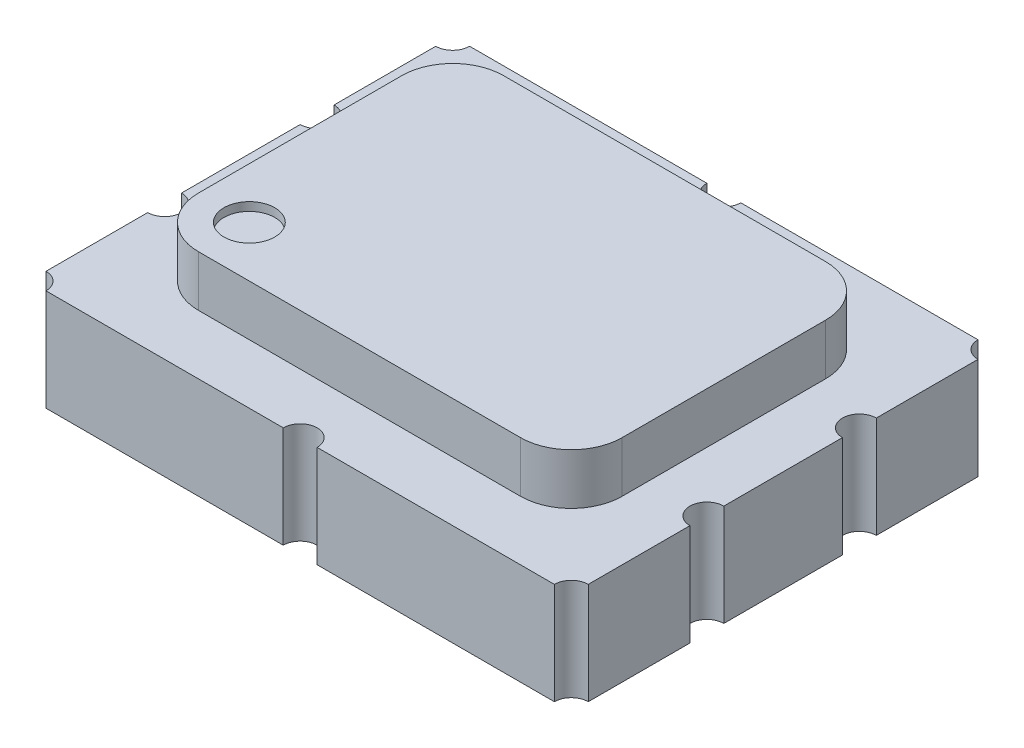
ISO-10303-21;
HEADER;
FILE_DESCRIPTION(('STEP AP214'),'2;1');
FILE_NAME('part.step','',(''),(''),'','','');
FILE_SCHEMA(('AUTOMOTIVE_DESIGN { 1 0 10303 214 1 1 1 1 }'));
ENDSEC;
DATA;
#1=APPLICATION_CONTEXT('core data for automotive mechanical design processes');
#2=APPLICATION_PROTOCOL_DEFINITION('international standard','automotive_design',2000,#1);
#3=PRODUCT_CONTEXT('',#1,'mechanical');
#4=PRODUCT('Part','Part','',(#3));
#5=PRODUCT_RELATED_PRODUCT_CATEGORY('part','',(#4));
#6=PRODUCT_DEFINITION_FORMATION('','',#4);
#7=PRODUCT_DEFINITION_CONTEXT('part definition',#1,'design');
#8=PRODUCT_DEFINITION('design','',#6,#7);
#9=PRODUCT_DEFINITION_SHAPE('','',#8);
#10=(LENGTH_UNIT() NAMED_UNIT(*) SI_UNIT(.MILLI.,.METRE.));
#11=(NAMED_UNIT(*) PLANE_ANGLE_UNIT() SI_UNIT($,.RADIAN.));
#12=(NAMED_UNIT(*) SI_UNIT($,.STERADIAN.) SOLID_ANGLE_UNIT());
#13=UNCERTAINTY_MEASURE_WITH_UNIT(LENGTH_MEASURE(1.E-05),#10,'distance_accuracy_value','');
#14=(GEOMETRIC_REPRESENTATION_CONTEXT(3) GLOBAL_UNCERTAINTY_ASSIGNED_CONTEXT((#13)) GLOBAL_UNIT_ASSIGNED_CONTEXT((#10,
#11,#12)) REPRESENTATION_CONTEXT('',''));
#15=CARTESIAN_POINT('',(0.,0.,0.));
#16=DIRECTION('',(0.,0.,1.));
#17=DIRECTION('',(1.,0.,0.));
#18=AXIS2_PLACEMENT_3D('',#15,#16,#17);
#19=CARTESIAN_POINT('',(1.6,0.6,-1.25));
#20=DIRECTION('',(-1.,0.,0.));
#21=DIRECTION('',(0.,0.,1.));
#22=AXIS2_PLACEMENT_3D('',#19,#20,#21);
#23=PLANE('',#22);
#24=DIRECTION('',(0.,0.,-1.));
#25=VECTOR('',#24,1.);
#26=CARTESIAN_POINT('',(1.6,0.6,-1.25));
#27=LINE('',#26,#25);
#28=CARTESIAN_POINT('',(1.6,0.6,1.15));
#29=VERTEX_POINT('',#28);
#30=CARTESIAN_POINT('',(1.6,0.6,0.55));
#31=VERTEX_POINT('',#30);
#32=EDGE_CURVE('E300',#29,#31,#27,.T.);
#33=ORIENTED_EDGE('',*,*,#32,.F.);
#34=DIRECTION('',(0.,1.,0.));
#35=VECTOR('',#34,1.);
#36=CARTESIAN_POINT('',(1.6,0.,1.15));
#37=LINE('',#36,#35);
#38=CARTESIAN_POINT('',(1.6,0.,1.15));
#39=VERTEX_POINT('',#38);
#40=EDGE_CURVE('E371',#29,#39,#37,.F.);
#41=ORIENTED_EDGE('',*,*,#40,.T.);
#42=DIRECTION('',(0.,0.,-1.));
#43=VECTOR('',#42,1.);
#44=CARTESIAN_POINT('',(1.6,0.,-1.25));
#45=LINE('',#44,#43);
#46=CARTESIAN_POINT('',(1.6,0.,0.55));
#47=VERTEX_POINT('',#46);
#48=EDGE_CURVE('E277',#39,#47,#45,.T.);
#49=ORIENTED_EDGE('',*,*,#48,.T.);
#50=DIRECTION('',(0.,1.,0.));
#51=VECTOR('',#50,1.);
#52=CARTESIAN_POINT('',(1.6,0.,0.55));
#53=LINE('',#52,#51);
#54=EDGE_CURVE('E416',#47,#31,#53,.T.);
#55=ORIENTED_EDGE('',*,*,#54,.T.);
#56=EDGE_LOOP('',(#33,#41,#49,#55));
#57=FACE_BOUND('',#56,.T.);
#58=ADVANCED_FACE('F41',(#57),#23,.F.);
#59=CARTESIAN_POINT('',(1.6,0.6,0.35));
#60=VERTEX_POINT('',#59);
#61=CARTESIAN_POINT('',(1.6,0.6,-0.35));
#62=VERTEX_POINT('',#61);
#63=EDGE_CURVE('E305',#60,#62,#27,.T.);
#64=ORIENTED_EDGE('',*,*,#63,.F.);
#65=DIRECTION('',(0.,1.,0.));
#66=VECTOR('',#65,1.);
#67=CARTESIAN_POINT('',(1.6,0.,0.35));
#68=LINE('',#67,#66);
#69=CARTESIAN_POINT('',(1.6,0.,0.35));
#70=VERTEX_POINT('',#69);
#71=EDGE_CURVE('E420',#60,#70,#68,.F.);
#72=ORIENTED_EDGE('',*,*,#71,.T.);
#73=CARTESIAN_POINT('',(1.6,0.,-0.35));
#74=VERTEX_POINT('',#73);
#75=EDGE_CURVE('E283',#70,#74,#45,.T.);
#76=ORIENTED_EDGE('',*,*,#75,.T.);
#77=DIRECTION('',(0.,1.,0.));
#78=VECTOR('',#77,1.);
#79=CARTESIAN_POINT('',(1.6,0.,-0.35));
#80=LINE('',#79,#78);
#81=EDGE_CURVE('E452',#74,#62,#80,.T.);
#82=ORIENTED_EDGE('',*,*,#81,.T.);
#83=EDGE_LOOP('',(#64,#72,#76,#82));
#84=FACE_BOUND('',#83,.T.);
#85=ADVANCED_FACE('F588',(#84),#23,.F.);
#86=CARTESIAN_POINT('',(-1.6,0.6,-1.25));
#87=DIRECTION('',(0.,0.,1.));
#88=DIRECTION('',(1.,0.,0.));
#89=AXIS2_PLACEMENT_3D('',#86,#87,#88);
#90=PLANE('',#89);
#91=DIRECTION('',(-1.,0.,0.));
#92=VECTOR('',#91,1.);
#93=CARTESIAN_POINT('',(-1.6,0.6,-1.25));
#94=LINE('',#93,#92);
#95=CARTESIAN_POINT('',(1.5,0.6,-1.25));
#96=VERTEX_POINT('',#95);
#97=CARTESIAN_POINT('',(0.1,0.6,-1.25));
#98=VERTEX_POINT('',#97);
#99=EDGE_CURVE('E295',#96,#98,#94,.T.);
#100=ORIENTED_EDGE('',*,*,#99,.F.);
#101=DIRECTION('',(0.,1.,0.));
#102=VECTOR('',#101,1.);
#103=CARTESIAN_POINT('',(1.5,0.,-1.25));
#104=LINE('',#103,#102);
#105=CARTESIAN_POINT('',(1.5,0.,-1.25));
#106=VERTEX_POINT('',#105);
#107=EDGE_CURVE('E443',#96,#106,#104,.F.);
#108=ORIENTED_EDGE('',*,*,#107,.T.);
#109=DIRECTION('',(-1.,0.,0.));
#110=VECTOR('',#109,1.);
#111=CARTESIAN_POINT('',(-1.6,0.,-1.25));
#112=LINE('',#111,#110);
#113=CARTESIAN_POINT('',(0.1,0.,-1.25));
#114=VERTEX_POINT('',#113);
#115=EDGE_CURVE('E265',#106,#114,#112,.T.);
#116=ORIENTED_EDGE('',*,*,#115,.T.);
#117=DIRECTION('',(0.,1.,0.));
#118=VECTOR('',#117,1.);
#119=CARTESIAN_POINT('',(0.1,0.,-1.25));
#120=LINE('',#119,#118);
#121=EDGE_CURVE('E65',#114,#98,#120,.T.);
#122=ORIENTED_EDGE('',*,*,#121,.T.);
#123=EDGE_LOOP('',(#100,#108,#116,#122));
#124=FACE_BOUND('',#123,.T.);
#125=ADVANCED_FACE('F593',(#124),#90,.F.);
#126=CARTESIAN_POINT('',(-1.6,0.6,-1.25));
#127=DIRECTION('',(1.,0.,0.));
#128=DIRECTION('',(0.,0.,-1.));
#129=AXIS2_PLACEMENT_3D('',#126,#127,#128);
#130=PLANE('',#129);
#131=DIRECTION('',(0.,0.,1.));
#132=VECTOR('',#131,1.);
#133=CARTESIAN_POINT('',(-1.6,0.,-1.25));
#134=LINE('',#133,#132);
#135=CARTESIAN_POINT('',(-1.6,0.,-1.15));
#136=VERTEX_POINT('',#135);
#137=CARTESIAN_POINT('',(-1.6,0.,-0.55));
#138=VERTEX_POINT('',#137);
#139=EDGE_CURVE('E241',#136,#138,#134,.T.);
#140=ORIENTED_EDGE('',*,*,#139,.T.);
#141=DIRECTION('',(0.,1.,0.));
#142=VECTOR('',#141,1.);
#143=CARTESIAN_POINT('',(-1.6,0.,-0.55));
#144=LINE('',#143,#142);
#145=CARTESIAN_POINT('',(-1.6,0.6,-0.55));
#146=VERTEX_POINT('',#145);
#147=EDGE_CURVE('E402',#138,#146,#144,.T.);
#148=ORIENTED_EDGE('',*,*,#147,.T.);
#149=DIRECTION('',(0.,0.,1.));
#150=VECTOR('',#149,1.);
#151=CARTESIAN_POINT('',(-1.6,0.6,-1.25));
#152=LINE('',#151,#150);
#153=CARTESIAN_POINT('',(-1.6,0.6,-1.15));
#154=VERTEX_POINT('',#153);
#155=EDGE_CURVE('E243',#154,#146,#152,.T.);
#156=ORIENTED_EDGE('',*,*,#155,.F.);
#157=DIRECTION('',(0.,1.,0.));
#158=VECTOR('',#157,1.);
#159=CARTESIAN_POINT('',(-1.6,0.,-1.15));
#160=LINE('',#159,#158);
#161=EDGE_CURVE('E227',#154,#136,#160,.F.);
#162=ORIENTED_EDGE('',*,*,#161,.T.);
#163=EDGE_LOOP('',(#140,#148,#156,#162));
#164=FACE_BOUND('',#163,.T.);
#165=ADVANCED_FACE('F239',(#164),#130,.F.);
#166=CARTESIAN_POINT('',(-1.6,0.6,-0.35));
#167=VERTEX_POINT('',#166);
#168=CARTESIAN_POINT('',(-1.6,0.6,0.35));
#169=VERTEX_POINT('',#168);
#170=EDGE_CURVE('E294',#167,#169,#152,.T.);
#171=ORIENTED_EDGE('',*,*,#170,.F.);
#172=DIRECTION('',(0.,1.,0.));
#173=VECTOR('',#172,1.);
#174=CARTESIAN_POINT('',(-1.6,0.,-0.35));
#175=LINE('',#174,#173);
#176=CARTESIAN_POINT('',(-1.6,0.,-0.35));
#177=VERTEX_POINT('',#176);
#178=EDGE_CURVE('E405',#167,#177,#175,.F.);
#179=ORIENTED_EDGE('',*,*,#178,.T.);
#180=CARTESIAN_POINT('',(-1.6,0.,0.35));
#181=VERTEX_POINT('',#180);
#182=EDGE_CURVE('E253',#177,#181,#134,.T.);
#183=ORIENTED_EDGE('',*,*,#182,.T.);
#184=DIRECTION('',(0.,1.,0.));
#185=VECTOR('',#184,1.);
#186=CARTESIAN_POINT('',(-1.6,0.,0.35));
#187=LINE('',#186,#185);
#188=EDGE_CURVE('E409',#181,#169,#187,.T.);
#189=ORIENTED_EDGE('',*,*,#188,.T.);
#190=EDGE_LOOP('',(#171,#179,#183,#189));
#191=FACE_BOUND('',#190,.T.);
#192=ADVANCED_FACE('F604',(#191),#130,.F.);
#193=CARTESIAN_POINT('',(-1.6,0.6,1.25));
#194=DIRECTION('',(0.,0.,-1.));
#195=DIRECTION('',(-1.,0.,0.));
#196=AXIS2_PLACEMENT_3D('',#193,#194,#195);
#197=PLANE('',#196);
#198=DIRECTION('',(1.,0.,0.));
#199=VECTOR('',#198,1.);
#200=CARTESIAN_POINT('',(-1.6,0.6,1.25));
#201=LINE('',#200,#199);
#202=CARTESIAN_POINT('',(-1.5,0.6,1.25));
#203=VERTEX_POINT('',#202);
#204=CARTESIAN_POINT('',(-0.0999999999999996,0.6,1.25));
#205=VERTEX_POINT('',#204);
#206=EDGE_CURVE('E289',#203,#205,#201,.T.);
#207=ORIENTED_EDGE('',*,*,#206,.F.);
#208=DIRECTION('',(0.,1.,0.));
#209=VECTOR('',#208,1.);
#210=CARTESIAN_POINT('',(-1.5,0.,1.25));
#211=LINE('',#210,#209);
#212=CARTESIAN_POINT('',(-1.5,0.,1.25));
#213=VERTEX_POINT('',#212);
#214=EDGE_CURVE('E427',#203,#213,#211,.F.);
#215=ORIENTED_EDGE('',*,*,#214,.T.);
#216=DIRECTION('',(1.,0.,0.));
#217=VECTOR('',#216,1.);
#218=CARTESIAN_POINT('',(-1.6,0.,1.25));
#219=LINE('',#218,#217);
#220=CARTESIAN_POINT('',(-0.0999999999999996,0.,1.25));
#221=VERTEX_POINT('',#220);
#222=EDGE_CURVE('E259',#213,#221,#219,.T.);
#223=ORIENTED_EDGE('',*,*,#222,.T.);
#224=DIRECTION('',(0.,1.,0.));
#225=VECTOR('',#224,1.);
#226=CARTESIAN_POINT('',(-0.0999999999999996,0.,1.25));
#227=LINE('',#226,#225);
#228=EDGE_CURVE('E431',#221,#205,#227,.T.);
#229=ORIENTED_EDGE('',*,*,#228,.T.);
#230=EDGE_LOOP('',(#207,#215,#223,#229));
#231=FACE_BOUND('',#230,.T.);
#232=ADVANCED_FACE('F584',(#231),#197,.F.);
#233=CARTESIAN_POINT('',(1.6,0.,-0.55));
#234=VERTEX_POINT('',#233);
#235=CARTESIAN_POINT('',(1.6,0.,-1.15));
#236=VERTEX_POINT('',#235);
#237=EDGE_CURVE('E279',#234,#236,#45,.T.);
#238=ORIENTED_EDGE('',*,*,#237,.T.);
#239=DIRECTION('',(0.,1.,0.));
#240=VECTOR('',#239,1.);
#241=CARTESIAN_POINT('',(1.6,0.,-1.15));
#242=LINE('',#241,#240);
#243=CARTESIAN_POINT('',(1.6,0.6,-1.15));
#244=VERTEX_POINT('',#243);
#245=EDGE_CURVE('E439',#236,#244,#242,.T.);
#246=ORIENTED_EDGE('',*,*,#245,.T.);
#247=CARTESIAN_POINT('',(1.6,0.6,-0.55));
#248=VERTEX_POINT('',#247);
#249=EDGE_CURVE('E301',#248,#244,#27,.T.);
#250=ORIENTED_EDGE('',*,*,#249,.F.);
#251=DIRECTION('',(0.,1.,0.));
#252=VECTOR('',#251,1.);
#253=CARTESIAN_POINT('',(1.6,0.,-0.55));
#254=LINE('',#253,#252);
#255=EDGE_CURVE('E456',#248,#234,#254,.F.);
#256=ORIENTED_EDGE('',*,*,#255,.T.);
#257=EDGE_LOOP('',(#238,#246,#250,#256));
#258=FACE_BOUND('',#257,.T.);
#259=ADVANCED_FACE('F43',(#258),#23,.F.);
#260=CARTESIAN_POINT('',(-0.1,0.6,-1.25));
#261=VERTEX_POINT('',#260);
#262=CARTESIAN_POINT('',(-1.5,0.6,-1.25));
#263=VERTEX_POINT('',#262);
#264=EDGE_CURVE('E296',#261,#263,#94,.T.);
#265=ORIENTED_EDGE('',*,*,#264,.F.);
#266=DIRECTION('',(0.,1.,0.));
#267=VECTOR('',#266,1.);
#268=CARTESIAN_POINT('',(-0.1,0.,-1.25));
#269=LINE('',#268,#267);
#270=CARTESIAN_POINT('',(-0.1,0.,-1.25));
#271=VERTEX_POINT('',#270);
#272=EDGE_CURVE('E448',#261,#271,#269,.F.);
#273=ORIENTED_EDGE('',*,*,#272,.T.);
#274=CARTESIAN_POINT('',(-1.5,0.,-1.25));
#275=VERTEX_POINT('',#274);
#276=EDGE_CURVE('E272',#271,#275,#112,.T.);
#277=ORIENTED_EDGE('',*,*,#276,.T.);
#278=DIRECTION('',(0.,1.,0.));
#279=VECTOR('',#278,1.);
#280=CARTESIAN_POINT('',(-1.5,0.,-1.25));
#281=LINE('',#280,#279);
#282=EDGE_CURVE('E57',#275,#263,#281,.T.);
#283=ORIENTED_EDGE('',*,*,#282,.T.);
#284=EDGE_LOOP('',(#265,#273,#277,#283));
#285=FACE_BOUND('',#284,.T.);
#286=ADVANCED_FACE('F597',(#285),#90,.F.);
#287=CARTESIAN_POINT('',(-1.6,0.6,0.55));
#288=VERTEX_POINT('',#287);
#289=CARTESIAN_POINT('',(-1.6,0.6,1.15));
#290=VERTEX_POINT('',#289);
#291=EDGE_CURVE('E290',#288,#290,#152,.T.);
#292=ORIENTED_EDGE('',*,*,#291,.F.);
#293=DIRECTION('',(0.,1.,0.));
#294=VECTOR('',#293,1.);
#295=CARTESIAN_POINT('',(-1.6,0.,0.55));
#296=LINE('',#295,#294);
#297=CARTESIAN_POINT('',(-1.6,0.,0.55));
#298=VERTEX_POINT('',#297);
#299=EDGE_CURVE('E413',#288,#298,#296,.F.);
#300=ORIENTED_EDGE('',*,*,#299,.T.);
#301=CARTESIAN_POINT('',(-1.6,0.,1.15));
#302=VERTEX_POINT('',#301);
#303=EDGE_CURVE('E255',#298,#302,#134,.T.);
#304=ORIENTED_EDGE('',*,*,#303,.T.);
#305=DIRECTION('',(0.,1.,0.));
#306=VECTOR('',#305,1.);
#307=CARTESIAN_POINT('',(-1.6,0.,1.15));
#308=LINE('',#307,#306);
#309=EDGE_CURVE('E424',#302,#290,#308,.T.);
#310=ORIENTED_EDGE('',*,*,#309,.T.);
#311=EDGE_LOOP('',(#292,#300,#304,#310));
#312=FACE_BOUND('',#311,.T.);
#313=ADVANCED_FACE('F581',(#312),#130,.F.);
#314=CARTESIAN_POINT('',(0.1,0.,1.25));
#315=VERTEX_POINT('',#314);
#316=CARTESIAN_POINT('',(1.5,0.,1.25));
#317=VERTEX_POINT('',#316);
#318=EDGE_CURVE('E252',#315,#317,#219,.T.);
#319=ORIENTED_EDGE('',*,*,#318,.T.);
#320=DIRECTION('',(0.,1.,0.));
#321=VECTOR('',#320,1.);
#322=CARTESIAN_POINT('',(1.5,0.,1.25));
#323=LINE('',#322,#321);
#324=CARTESIAN_POINT('',(1.5,0.6,1.25));
#325=VERTEX_POINT('',#324);
#326=EDGE_CURVE('E398',#317,#325,#323,.T.);
#327=ORIENTED_EDGE('',*,*,#326,.T.);
#328=CARTESIAN_POINT('',(0.1,0.6,1.25));
#329=VERTEX_POINT('',#328);
#330=EDGE_CURVE('E285',#329,#325,#201,.T.);
#331=ORIENTED_EDGE('',*,*,#330,.F.);
#332=DIRECTION('',(0.,1.,0.));
#333=VECTOR('',#332,1.);
#334=CARTESIAN_POINT('',(0.1,0.,1.25));
#335=LINE('',#334,#333);
#336=EDGE_CURVE('E435',#329,#315,#335,.F.);
#337=ORIENTED_EDGE('',*,*,#336,.T.);
#338=EDGE_LOOP('',(#319,#327,#331,#337));
#339=FACE_BOUND('',#338,.T.);
#340=ADVANCED_FACE('F573',(#339),#197,.F.);
#341=CARTESIAN_POINT('',(0.,0.6,0.));
#342=DIRECTION('',(0.,1.,0.));
#343=DIRECTION('',(0.,0.,1.));
#344=AXIS2_PLACEMENT_3D('',#341,#342,#343);
#345=PLANE('',#344);
#346=CARTESIAN_POINT('',(1.6,0.6,1.25));
#347=DIRECTION('',(0.,1.,0.));
#348=DIRECTION('',(0.,0.,1.));
#349=AXIS2_PLACEMENT_3D('',#346,#347,#348);
#350=CIRCLE('',#349,0.1);
#351=EDGE_CURVE('E491',#29,#325,#350,.T.);
#352=ORIENTED_EDGE('',*,*,#351,.F.);
#353=ORIENTED_EDGE('',*,*,#32,.T.);
#354=CARTESIAN_POINT('',(1.6,0.6,0.45));
#355=DIRECTION('',(0.,1.,0.));
#356=DIRECTION('',(0.,0.,-1.));
#357=AXIS2_PLACEMENT_3D('',#354,#355,#356);
#358=CIRCLE('',#357,0.1);
#359=EDGE_CURVE('E497',#60,#31,#358,.T.);
#360=ORIENTED_EDGE('',*,*,#359,.F.);
#361=ORIENTED_EDGE('',*,*,#63,.T.);
#362=CARTESIAN_POINT('',(1.6,0.6,-0.45));
#363=DIRECTION('',(0.,1.,0.));
#364=DIRECTION('',(0.,0.,-1.));
#365=AXIS2_PLACEMENT_3D('',#362,#363,#364);
#366=CIRCLE('',#365,0.1);
#367=EDGE_CURVE('E511',#248,#62,#366,.T.);
#368=ORIENTED_EDGE('',*,*,#367,.F.);
#369=ORIENTED_EDGE('',*,*,#249,.T.);
#370=CARTESIAN_POINT('',(1.6,0.6,-1.25));
#371=DIRECTION('',(0.,1.,0.));
#372=DIRECTION('',(0.,0.,1.));
#373=AXIS2_PLACEMENT_3D('',#370,#371,#372);
#374=CIRCLE('',#373,0.1);
#375=EDGE_CURVE('E480',#96,#244,#374,.T.);
#376=ORIENTED_EDGE('',*,*,#375,.F.);
#377=ORIENTED_EDGE('',*,*,#99,.T.);
#378=CARTESIAN_POINT('',(0.,0.6,-1.25));
#379=DIRECTION('',(0.,1.,0.));
#380=DIRECTION('',(0.,0.,1.));
#381=AXIS2_PLACEMENT_3D('',#378,#379,#380);
#382=CIRCLE('',#381,0.1);
#383=EDGE_CURVE('E463',#261,#98,#382,.T.);
#384=ORIENTED_EDGE('',*,*,#383,.F.);
#385=ORIENTED_EDGE('',*,*,#264,.T.);
#386=CARTESIAN_POINT('',(-1.6,0.6,-1.25));
#387=DIRECTION('',(0.,1.,0.));
#388=DIRECTION('',(0.,0.,1.));
#389=AXIS2_PLACEMENT_3D('',#386,#387,#388);
#390=CIRCLE('',#389,0.1);
#391=EDGE_CURVE('E234',#154,#263,#390,.T.);
#392=ORIENTED_EDGE('',*,*,#391,.F.);
#393=ORIENTED_EDGE('',*,*,#155,.T.);
#394=CARTESIAN_POINT('',(-1.6,0.6,-0.45));
#395=DIRECTION('',(0.,1.,0.));
#396=DIRECTION('',(0.,0.,1.));
#397=AXIS2_PLACEMENT_3D('',#394,#395,#396);
#398=CIRCLE('',#397,0.1);
#399=EDGE_CURVE('E485',#167,#146,#398,.T.);
#400=ORIENTED_EDGE('',*,*,#399,.F.);
#401=ORIENTED_EDGE('',*,*,#170,.T.);
#402=CARTESIAN_POINT('',(-1.6,0.6,0.45));
#403=DIRECTION('',(0.,1.,0.));
#404=DIRECTION('',(0.,0.,1.));
#405=AXIS2_PLACEMENT_3D('',#402,#403,#404);
#406=CIRCLE('',#405,0.1);
#407=EDGE_CURVE('E505',#288,#169,#406,.T.);
#408=ORIENTED_EDGE('',*,*,#407,.F.);
#409=ORIENTED_EDGE('',*,*,#291,.T.);
#410=CARTESIAN_POINT('',(-1.6,0.6,1.25));
#411=DIRECTION('',(0.,1.,0.));
#412=DIRECTION('',(0.,0.,1.));
#413=AXIS2_PLACEMENT_3D('',#410,#411,#412);
#414=CIRCLE('',#413,0.1);
#415=EDGE_CURVE('E465',#203,#290,#414,.T.);
#416=ORIENTED_EDGE('',*,*,#415,.F.);
#417=ORIENTED_EDGE('',*,*,#206,.T.);
#418=CARTESIAN_POINT('',(0.,0.6,1.25));
#419=DIRECTION('',(0.,1.,0.));
#420=DIRECTION('',(0.,0.,1.));
#421=AXIS2_PLACEMENT_3D('',#418,#419,#420);
#422=CIRCLE('',#421,0.1);
#423=EDGE_CURVE('E473',#329,#205,#422,.T.);
#424=ORIENTED_EDGE('',*,*,#423,.F.);
#425=ORIENTED_EDGE('',*,*,#330,.T.);
#426=EDGE_LOOP('',(#352,#353,#360,#361,#368,#369,#376,#377,#384,#385,#392,#393,#400,#401,#408,
#409,#416,#417,#424,#425));
#427=FACE_BOUND('',#426,.T.);
#428=CARTESIAN_POINT('',(0.950000000000001,0.6,0.6));
#429=DIRECTION('',(0.,1.,0.));
#430=DIRECTION('',(0.,0.,1.));
#431=AXIS2_PLACEMENT_3D('',#428,#429,#430);
#432=CIRCLE('',#431,0.3);
#433=CARTESIAN_POINT('',(0.949999999999998,0.6,0.9));
#434=VERTEX_POINT('',#433);
#435=CARTESIAN_POINT('',(1.25,0.6,0.599999999999997));
#436=VERTEX_POINT('',#435);
#437=EDGE_CURVE('E367',#434,#436,#432,.T.);
#438=ORIENTED_EDGE('',*,*,#437,.F.);
#439=DIRECTION('',(1.,0.,0.));
#440=VECTOR('',#439,1.);
#441=CARTESIAN_POINT('',(-0.949999999999998,0.6,0.9));
#442=LINE('',#441,#440);
#443=CARTESIAN_POINT('',(-0.949999999999998,0.6,0.9));
#444=VERTEX_POINT('',#443);
#445=EDGE_CURVE('E338',#444,#434,#442,.T.);
#446=ORIENTED_EDGE('',*,*,#445,.F.);
#447=CARTESIAN_POINT('',(-0.950000000000001,0.6,0.6));
#448=DIRECTION('',(0.,1.,0.));
#449=DIRECTION('',(0.,0.,-1.));
#450=AXIS2_PLACEMENT_3D('',#447,#448,#449);
#451=CIRCLE('',#450,0.3);
#452=CARTESIAN_POINT('',(-1.25,0.6,0.599999999999998));
#453=VERTEX_POINT('',#452);
#454=EDGE_CURVE('E343',#453,#444,#451,.T.);
#455=ORIENTED_EDGE('',*,*,#454,.F.);
#456=DIRECTION('',(0.,0.,1.));
#457=VECTOR('',#456,1.);
#458=CARTESIAN_POINT('',(-1.25,0.6,0.599999999999997));
#459=LINE('',#458,#457);
#460=CARTESIAN_POINT('',(-1.25,0.6,-0.599999999999997));
#461=VERTEX_POINT('',#460);
#462=EDGE_CURVE('E347',#461,#453,#459,.T.);
#463=ORIENTED_EDGE('',*,*,#462,.F.);
#464=CARTESIAN_POINT('',(-0.950000000000001,0.6,-0.6));
#465=DIRECTION('',(0.,1.,0.));
#466=DIRECTION('',(0.,0.,-1.));
#467=AXIS2_PLACEMENT_3D('',#464,#465,#466);
#468=CIRCLE('',#467,0.3);
#469=CARTESIAN_POINT('',(-0.950000000000001,0.6,-0.9));
#470=VERTEX_POINT('',#469);
#471=EDGE_CURVE('E351',#470,#461,#468,.T.);
#472=ORIENTED_EDGE('',*,*,#471,.F.);
#473=DIRECTION('',(-1.,0.,0.));
#474=VECTOR('',#473,1.);
#475=CARTESIAN_POINT('',(-0.949999999999998,0.6,-0.9));
#476=LINE('',#475,#474);
#477=CARTESIAN_POINT('',(0.949999999999998,0.6,-0.9));
#478=VERTEX_POINT('',#477);
#479=EDGE_CURVE('E355',#478,#470,#476,.T.);
#480=ORIENTED_EDGE('',*,*,#479,.F.);
#481=CARTESIAN_POINT('',(0.950000000000001,0.6,-0.6));
#482=DIRECTION('',(0.,1.,0.));
#483=DIRECTION('',(0.,0.,-1.));
#484=AXIS2_PLACEMENT_3D('',#481,#482,#483);
#485=CIRCLE('',#484,0.3);
#486=CARTESIAN_POINT('',(1.25,0.6,-0.599999999999998));
#487=VERTEX_POINT('',#486);
#488=EDGE_CURVE('E359',#487,#478,#485,.T.);
#489=ORIENTED_EDGE('',*,*,#488,.F.);
#490=DIRECTION('',(0.,0.,-1.));
#491=VECTOR('',#490,1.);
#492=CARTESIAN_POINT('',(1.25,0.6,0.599999999999997));
#493=LINE('',#492,#491);
#494=EDGE_CURVE('E363',#436,#487,#493,.T.);
#495=ORIENTED_EDGE('',*,*,#494,.F.);
#496=EDGE_LOOP('',(#438,#446,#455,#463,#472,#480,#489,#495));
#497=FACE_BOUND('',#496,.T.);
#498=ADVANCED_FACE('F571',(#427,#497),#345,.T.);
#499=CARTESIAN_POINT('',(0.,0.,0.));
#500=DIRECTION('',(0.,1.,0.));
#501=DIRECTION('',(0.,0.,1.));
#502=AXIS2_PLACEMENT_3D('',#499,#500,#501);
#503=PLANE('',#502);
#504=ORIENTED_EDGE('',*,*,#48,.F.);
#505=CARTESIAN_POINT('',(1.6,0.,1.25));
#506=DIRECTION('',(0.,1.,0.));
#507=DIRECTION('',(0.,0.,1.));
#508=AXIS2_PLACEMENT_3D('',#505,#506,#507);
#509=CIRCLE('',#508,0.1);
#510=EDGE_CURVE('E469',#39,#317,#509,.T.);
#511=ORIENTED_EDGE('',*,*,#510,.T.);
#512=ORIENTED_EDGE('',*,*,#318,.F.);
#513=CARTESIAN_POINT('',(0.,0.,1.25));
#514=DIRECTION('',(0.,1.,0.));
#515=DIRECTION('',(0.,0.,1.));
#516=AXIS2_PLACEMENT_3D('',#513,#514,#515);
#517=CIRCLE('',#516,0.1);
#518=EDGE_CURVE('E476',#315,#221,#517,.T.);
#519=ORIENTED_EDGE('',*,*,#518,.T.);
#520=ORIENTED_EDGE('',*,*,#222,.F.);
#521=CARTESIAN_POINT('',(-1.6,0.,1.25));
#522=DIRECTION('',(0.,1.,0.));
#523=DIRECTION('',(0.,0.,1.));
#524=AXIS2_PLACEMENT_3D('',#521,#522,#523);
#525=CIRCLE('',#524,0.1);
#526=EDGE_CURVE('E468',#213,#302,#525,.T.);
#527=ORIENTED_EDGE('',*,*,#526,.T.);
#528=ORIENTED_EDGE('',*,*,#303,.F.);
#529=CARTESIAN_POINT('',(-1.6,0.,0.45));
#530=DIRECTION('',(0.,1.,0.));
#531=DIRECTION('',(0.,0.,1.));
#532=AXIS2_PLACEMENT_3D('',#529,#530,#531);
#533=CIRCLE('',#532,0.1);
#534=EDGE_CURVE('E488',#298,#181,#533,.T.);
#535=ORIENTED_EDGE('',*,*,#534,.T.);
#536=ORIENTED_EDGE('',*,*,#182,.F.);
#537=CARTESIAN_POINT('',(-1.6,0.,-0.45));
#538=DIRECTION('',(0.,1.,0.));
#539=DIRECTION('',(0.,0.,1.));
#540=AXIS2_PLACEMENT_3D('',#537,#538,#539);
#541=CIRCLE('',#540,0.1);
#542=EDGE_CURVE('E250',#177,#138,#541,.T.);
#543=ORIENTED_EDGE('',*,*,#542,.T.);
#544=ORIENTED_EDGE('',*,*,#139,.F.);
#545=CARTESIAN_POINT('',(-1.6,0.,-1.25));
#546=DIRECTION('',(0.,1.,0.));
#547=DIRECTION('',(0.,0.,1.));
#548=AXIS2_PLACEMENT_3D('',#545,#546,#547);
#549=CIRCLE('',#548,0.1);
#550=EDGE_CURVE('E224',#136,#275,#549,.T.);
#551=ORIENTED_EDGE('',*,*,#550,.T.);
#552=ORIENTED_EDGE('',*,*,#276,.F.);
#553=CARTESIAN_POINT('',(0.,0.,-1.25));
#554=DIRECTION('',(0.,1.,0.));
#555=DIRECTION('',(0.,0.,1.));
#556=AXIS2_PLACEMENT_3D('',#553,#554,#555);
#557=CIRCLE('',#556,0.1);
#558=EDGE_CURVE('E50',#271,#114,#557,.T.);
#559=ORIENTED_EDGE('',*,*,#558,.T.);
#560=ORIENTED_EDGE('',*,*,#115,.F.);
#561=CARTESIAN_POINT('',(1.6,0.,-1.25));
#562=DIRECTION('',(0.,1.,0.));
#563=DIRECTION('',(0.,0.,1.));
#564=AXIS2_PLACEMENT_3D('',#561,#562,#563);
#565=CIRCLE('',#564,0.1);
#566=EDGE_CURVE('E11',#106,#236,#565,.T.);
#567=ORIENTED_EDGE('',*,*,#566,.T.);
#568=ORIENTED_EDGE('',*,*,#237,.F.);
#569=CARTESIAN_POINT('',(1.6,0.,-0.45));
#570=DIRECTION('',(0.,1.,0.));
#571=DIRECTION('',(0.,0.,-1.));
#572=AXIS2_PLACEMENT_3D('',#569,#570,#571);
#573=CIRCLE('',#572,0.1);
#574=EDGE_CURVE('E501',#234,#74,#573,.T.);
#575=ORIENTED_EDGE('',*,*,#574,.T.);
#576=ORIENTED_EDGE('',*,*,#75,.F.);
#577=CARTESIAN_POINT('',(1.6,0.,0.45));
#578=DIRECTION('',(0.,1.,0.));
#579=DIRECTION('',(0.,0.,-1.));
#580=AXIS2_PLACEMENT_3D('',#577,#578,#579);
#581=CIRCLE('',#580,0.1);
#582=EDGE_CURVE('E500',#70,#47,#581,.T.);
#583=ORIENTED_EDGE('',*,*,#582,.T.);
#584=EDGE_LOOP('',(#504,#511,#512,#519,#520,#527,#528,#535,#536,#543,#544,#551,#552,#559,#560,
#567,#568,#575,#576,#583));
#585=FACE_BOUND('',#584,.T.);
#586=ADVANCED_FACE('F248',(#585),#503,.F.);
#587=CARTESIAN_POINT('',(0.950000000000001,0.9,0.6));
#588=DIRECTION('',(0.,-1.,0.));
#589=DIRECTION('',(0.,0.,-1.));
#590=AXIS2_PLACEMENT_3D('',#587,#588,#589);
#591=CYLINDRICAL_SURFACE('',#590,0.3);
#592=ORIENTED_EDGE('',*,*,#437,.T.);
#593=DIRECTION('',(0.,-1.,0.));
#594=VECTOR('',#593,1.);
#595=CARTESIAN_POINT('',(1.25,0.9,0.599999999999997));
#596=LINE('',#595,#594);
#597=CARTESIAN_POINT('',(1.25,0.9,0.599999999999997));
#598=VERTEX_POINT('',#597);
#599=EDGE_CURVE('E284',#598,#436,#596,.T.);
#600=ORIENTED_EDGE('',*,*,#599,.F.);
#601=CARTESIAN_POINT('',(0.950000000000001,0.9,0.6));
#602=DIRECTION('',(0.,1.,0.));
#603=DIRECTION('',(0.,0.,1.));
#604=AXIS2_PLACEMENT_3D('',#601,#602,#603);
#605=CIRCLE('',#604,0.3);
#606=CARTESIAN_POINT('',(0.949999999999998,0.9,0.9));
#607=VERTEX_POINT('',#606);
#608=EDGE_CURVE('E342',#607,#598,#605,.T.);
#609=ORIENTED_EDGE('',*,*,#608,.F.);
#610=DIRECTION('',(0.,-1.,0.));
#611=VECTOR('',#610,1.);
#612=CARTESIAN_POINT('',(0.949999999999998,0.9,0.9));
#613=LINE('',#612,#611);
#614=EDGE_CURVE('E333',#607,#434,#613,.T.);
#615=ORIENTED_EDGE('',*,*,#614,.T.);
#616=EDGE_LOOP('',(#592,#600,#609,#615));
#617=FACE_BOUND('',#616,.T.);
#618=ADVANCED_FACE('F546',(#617),#591,.T.);
#619=CARTESIAN_POINT('',(1.25,0.9,0.599999999999997));
#620=DIRECTION('',(-1.,0.,0.));
#621=DIRECTION('',(0.,0.,1.));
#622=AXIS2_PLACEMENT_3D('',#619,#620,#621);
#623=PLANE('',#622);
#624=ORIENTED_EDGE('',*,*,#494,.T.);
#625=DIRECTION('',(0.,-1.,0.));
#626=VECTOR('',#625,1.);
#627=CARTESIAN_POINT('',(1.25,0.9,-0.599999999999998));
#628=LINE('',#627,#626);
#629=CARTESIAN_POINT('',(1.25,0.9,-0.599999999999998));
#630=VERTEX_POINT('',#629);
#631=EDGE_CURVE('E309',#630,#487,#628,.T.);
#632=ORIENTED_EDGE('',*,*,#631,.F.);
#633=DIRECTION('',(0.,0.,-1.));
#634=VECTOR('',#633,1.);
#635=CARTESIAN_POINT('',(1.25,0.9,0.599999999999997));
#636=LINE('',#635,#634);
#637=EDGE_CURVE('E389',#598,#630,#636,.T.);
#638=ORIENTED_EDGE('',*,*,#637,.F.);
#639=ORIENTED_EDGE('',*,*,#599,.T.);
#640=EDGE_LOOP('',(#624,#632,#638,#639));
#641=FACE_BOUND('',#640,.T.);
#642=ADVANCED_FACE('F548',(#641),#623,.F.);
#643=CARTESIAN_POINT('',(0.950000000000001,0.9,-0.6));
#644=DIRECTION('',(0.,-1.,0.));
#645=DIRECTION('',(0.,0.,-1.));
#646=AXIS2_PLACEMENT_3D('',#643,#644,#645);
#647=CYLINDRICAL_SURFACE('',#646,0.3);
#648=ORIENTED_EDGE('',*,*,#488,.T.);
#649=DIRECTION('',(0.,-1.,0.));
#650=VECTOR('',#649,1.);
#651=CARTESIAN_POINT('',(0.949999999999998,0.9,-0.9));
#652=LINE('',#651,#650);
#653=CARTESIAN_POINT('',(0.949999999999998,0.9,-0.9));
#654=VERTEX_POINT('',#653);
#655=EDGE_CURVE('E313',#654,#478,#652,.T.);
#656=ORIENTED_EDGE('',*,*,#655,.F.);
#657=CARTESIAN_POINT('',(0.950000000000001,0.9,-0.6));
#658=DIRECTION('',(0.,1.,0.));
#659=DIRECTION('',(0.,0.,-1.));
#660=AXIS2_PLACEMENT_3D('',#657,#658,#659);
#661=CIRCLE('',#660,0.3);
#662=EDGE_CURVE('E386',#630,#654,#661,.T.);
#663=ORIENTED_EDGE('',*,*,#662,.F.);
#664=ORIENTED_EDGE('',*,*,#631,.T.);
#665=EDGE_LOOP('',(#648,#656,#663,#664));
#666=FACE_BOUND('',#665,.T.);
#667=ADVANCED_FACE('F552',(#666),#647,.T.);
#668=CARTESIAN_POINT('',(-0.949999999999998,0.9,-0.9));
#669=DIRECTION('',(0.,0.,1.));
#670=DIRECTION('',(1.,0.,0.));
#671=AXIS2_PLACEMENT_3D('',#668,#669,#670);
#672=PLANE('',#671);
#673=ORIENTED_EDGE('',*,*,#479,.T.);
#674=DIRECTION('',(0.,-1.,0.));
#675=VECTOR('',#674,1.);
#676=CARTESIAN_POINT('',(-0.950000000000001,0.9,-0.9));
#677=LINE('',#676,#675);
#678=CARTESIAN_POINT('',(-0.950000000000001,0.9,-0.9));
#679=VERTEX_POINT('',#678);
#680=EDGE_CURVE('E317',#679,#470,#677,.T.);
#681=ORIENTED_EDGE('',*,*,#680,.F.);
#682=DIRECTION('',(-1.,0.,0.));
#683=VECTOR('',#682,1.);
#684=CARTESIAN_POINT('',(-0.949999999999998,0.9,-0.9));
#685=LINE('',#684,#683);
#686=EDGE_CURVE('E383',#654,#679,#685,.T.);
#687=ORIENTED_EDGE('',*,*,#686,.F.);
#688=ORIENTED_EDGE('',*,*,#655,.T.);
#689=EDGE_LOOP('',(#673,#681,#687,#688));
#690=FACE_BOUND('',#689,.T.);
#691=ADVANCED_FACE('F558',(#690),#672,.F.);
#692=CARTESIAN_POINT('',(-0.950000000000001,0.9,-0.6));
#693=DIRECTION('',(0.,-1.,0.));
#694=DIRECTION('',(0.,0.,-1.));
#695=AXIS2_PLACEMENT_3D('',#692,#693,#694);
#696=CYLINDRICAL_SURFACE('',#695,0.3);
#697=ORIENTED_EDGE('',*,*,#471,.T.);
#698=DIRECTION('',(0.,-1.,0.));
#699=VECTOR('',#698,1.);
#700=CARTESIAN_POINT('',(-1.25,0.9,-0.599999999999997));
#701=LINE('',#700,#699);
#702=CARTESIAN_POINT('',(-1.25,0.9,-0.599999999999997));
#703=VERTEX_POINT('',#702);
#704=EDGE_CURVE('E321',#703,#461,#701,.T.);
#705=ORIENTED_EDGE('',*,*,#704,.F.);
#706=CARTESIAN_POINT('',(-0.950000000000001,0.9,-0.6));
#707=DIRECTION('',(0.,1.,0.));
#708=DIRECTION('',(0.,0.,-1.));
#709=AXIS2_PLACEMENT_3D('',#706,#707,#708);
#710=CIRCLE('',#709,0.3);
#711=EDGE_CURVE('E380',#679,#703,#710,.T.);
#712=ORIENTED_EDGE('',*,*,#711,.F.);
#713=ORIENTED_EDGE('',*,*,#680,.T.);
#714=EDGE_LOOP('',(#697,#705,#712,#713));
#715=FACE_BOUND('',#714,.T.);
#716=ADVANCED_FACE('F560',(#715),#696,.T.);
#717=CARTESIAN_POINT('',(-1.25,0.9,0.599999999999997));
#718=DIRECTION('',(1.,0.,0.));
#719=DIRECTION('',(0.,0.,-1.));
#720=AXIS2_PLACEMENT_3D('',#717,#718,#719);
#721=PLANE('',#720);
#722=ORIENTED_EDGE('',*,*,#462,.T.);
#723=DIRECTION('',(0.,-1.,0.));
#724=VECTOR('',#723,1.);
#725=CARTESIAN_POINT('',(-1.25,0.9,0.599999999999998));
#726=LINE('',#725,#724);
#727=CARTESIAN_POINT('',(-1.25,0.9,0.599999999999998));
#728=VERTEX_POINT('',#727);
#729=EDGE_CURVE('E325',#728,#453,#726,.T.);
#730=ORIENTED_EDGE('',*,*,#729,.F.);
#731=DIRECTION('',(0.,0.,1.));
#732=VECTOR('',#731,1.);
#733=CARTESIAN_POINT('',(-1.25,0.9,0.599999999999997));
#734=LINE('',#733,#732);
#735=EDGE_CURVE('E377',#703,#728,#734,.T.);
#736=ORIENTED_EDGE('',*,*,#735,.F.);
#737=ORIENTED_EDGE('',*,*,#704,.T.);
#738=EDGE_LOOP('',(#722,#730,#736,#737));
#739=FACE_BOUND('',#738,.T.);
#740=ADVANCED_FACE('F564',(#739),#721,.F.);
#741=CARTESIAN_POINT('',(-0.950000000000001,0.9,0.6));
#742=DIRECTION('',(0.,-1.,0.));
#743=DIRECTION('',(0.,0.,-1.));
#744=AXIS2_PLACEMENT_3D('',#741,#742,#743);
#745=CYLINDRICAL_SURFACE('',#744,0.3);
#746=ORIENTED_EDGE('',*,*,#454,.T.);
#747=DIRECTION('',(0.,-1.,0.));
#748=VECTOR('',#747,1.);
#749=CARTESIAN_POINT('',(-0.949999999999998,0.9,0.9));
#750=LINE('',#749,#748);
#751=CARTESIAN_POINT('',(-0.949999999999998,0.9,0.9));
#752=VERTEX_POINT('',#751);
#753=EDGE_CURVE('E329',#752,#444,#750,.T.);
#754=ORIENTED_EDGE('',*,*,#753,.F.);
#755=CARTESIAN_POINT('',(-0.950000000000001,0.9,0.6));
#756=DIRECTION('',(0.,1.,0.));
#757=DIRECTION('',(0.,0.,-1.));
#758=AXIS2_PLACEMENT_3D('',#755,#756,#757);
#759=CIRCLE('',#758,0.3);
#760=EDGE_CURVE('E374',#728,#752,#759,.T.);
#761=ORIENTED_EDGE('',*,*,#760,.F.);
#762=ORIENTED_EDGE('',*,*,#729,.T.);
#763=EDGE_LOOP('',(#746,#754,#761,#762));
#764=FACE_BOUND('',#763,.T.);
#765=ADVANCED_FACE('F568',(#764),#745,.T.);
#766=CARTESIAN_POINT('',(-0.949999999999998,0.9,0.9));
#767=DIRECTION('',(0.,0.,-1.));
#768=DIRECTION('',(-1.,0.,0.));
#769=AXIS2_PLACEMENT_3D('',#766,#767,#768);
#770=PLANE('',#769);
#771=ORIENTED_EDGE('',*,*,#445,.T.);
#772=ORIENTED_EDGE('',*,*,#614,.F.);
#773=DIRECTION('',(1.,0.,0.));
#774=VECTOR('',#773,1.);
#775=CARTESIAN_POINT('',(-0.949999999999998,0.9,0.9));
#776=LINE('',#775,#774);
#777=EDGE_CURVE('E337',#752,#607,#776,.T.);
#778=ORIENTED_EDGE('',*,*,#777,.F.);
#779=ORIENTED_EDGE('',*,*,#753,.T.);
#780=EDGE_LOOP('',(#771,#772,#778,#779));
#781=FACE_BOUND('',#780,.T.);
#782=ADVANCED_FACE('F538',(#781),#770,.F.);
#783=CARTESIAN_POINT('',(0.950000000000001,0.9,0.6));
#784=DIRECTION('',(0.,1.,0.));
#785=DIRECTION('',(0.,0.,1.));
#786=AXIS2_PLACEMENT_3D('',#783,#784,#785);
#787=PLANE('',#786);
#788=CARTESIAN_POINT('',(-0.950000000000001,0.9,0.6));
#789=DIRECTION('',(0.,1.,0.));
#790=DIRECTION('',(0.,0.,1.));
#791=AXIS2_PLACEMENT_3D('',#788,#789,#790);
#792=CIRCLE('',#791,0.15);
#793=CARTESIAN_POINT('',(-0.950000000000001,0.9,0.75));
#794=VERTEX_POINT('',#793);
#795=EDGE_CURVE('E518',#794,#794,#792,.T.);
#796=ORIENTED_EDGE('',*,*,#795,.F.);
#797=EDGE_LOOP('',(#796));
#798=FACE_BOUND('',#797,.T.);
#799=ORIENTED_EDGE('',*,*,#608,.T.);
#800=ORIENTED_EDGE('',*,*,#637,.T.);
#801=ORIENTED_EDGE('',*,*,#662,.T.);
#802=ORIENTED_EDGE('',*,*,#686,.T.);
#803=ORIENTED_EDGE('',*,*,#711,.T.);
#804=ORIENTED_EDGE('',*,*,#735,.T.);
#805=ORIENTED_EDGE('',*,*,#760,.T.);
#806=ORIENTED_EDGE('',*,*,#777,.T.);
#807=EDGE_LOOP('',(#799,#800,#801,#802,#803,#804,#805,#806));
#808=FACE_BOUND('',#807,.T.);
#809=ADVANCED_FACE('F535',(#798,#808),#787,.T.);
#810=CARTESIAN_POINT('',(-1.6,0.,-1.25));
#811=DIRECTION('',(0.,1.,0.));
#812=DIRECTION('',(0.,0.,1.));
#813=AXIS2_PLACEMENT_3D('',#810,#811,#812);
#814=CYLINDRICAL_SURFACE('',#813,0.1);
#815=ORIENTED_EDGE('',*,*,#550,.F.);
#816=ORIENTED_EDGE('',*,*,#161,.F.);
#817=ORIENTED_EDGE('',*,*,#391,.T.);
#818=ORIENTED_EDGE('',*,*,#282,.F.);
#819=EDGE_LOOP('',(#815,#816,#817,#818));
#820=FACE_BOUND('',#819,.T.);
#821=ADVANCED_FACE('F226',(#820),#814,.F.);
#822=CARTESIAN_POINT('',(1.6,0.,-0.45));
#823=DIRECTION('',(0.,1.,0.));
#824=DIRECTION('',(0.,0.,1.));
#825=AXIS2_PLACEMENT_3D('',#822,#823,#824);
#826=CYLINDRICAL_SURFACE('',#825,0.1);
#827=ORIENTED_EDGE('',*,*,#574,.F.);
#828=ORIENTED_EDGE('',*,*,#255,.F.);
#829=ORIENTED_EDGE('',*,*,#367,.T.);
#830=ORIENTED_EDGE('',*,*,#81,.F.);
#831=EDGE_LOOP('',(#827,#828,#829,#830));
#832=FACE_BOUND('',#831,.T.);
#833=ADVANCED_FACE('F645',(#832),#826,.F.);
#834=CARTESIAN_POINT('',(0.,0.,-1.25));
#835=DIRECTION('',(0.,1.,0.));
#836=DIRECTION('',(0.,0.,1.));
#837=AXIS2_PLACEMENT_3D('',#834,#835,#836);
#838=CYLINDRICAL_SURFACE('',#837,0.1);
#839=ORIENTED_EDGE('',*,*,#558,.F.);
#840=ORIENTED_EDGE('',*,*,#272,.F.);
#841=ORIENTED_EDGE('',*,*,#383,.T.);
#842=ORIENTED_EDGE('',*,*,#121,.F.);
#843=EDGE_LOOP('',(#839,#840,#841,#842));
#844=FACE_BOUND('',#843,.T.);
#845=ADVANCED_FACE('F647',(#844),#838,.F.);
#846=CARTESIAN_POINT('',(1.6,0.,-1.25));
#847=DIRECTION('',(0.,1.,0.));
#848=DIRECTION('',(0.,0.,1.));
#849=AXIS2_PLACEMENT_3D('',#846,#847,#848);
#850=CYLINDRICAL_SURFACE('',#849,0.1);
#851=ORIENTED_EDGE('',*,*,#566,.F.);
#852=ORIENTED_EDGE('',*,*,#107,.F.);
#853=ORIENTED_EDGE('',*,*,#375,.T.);
#854=ORIENTED_EDGE('',*,*,#245,.F.);
#855=EDGE_LOOP('',(#851,#852,#853,#854));
#856=FACE_BOUND('',#855,.T.);
#857=ADVANCED_FACE('F611',(#856),#850,.F.);
#858=CARTESIAN_POINT('',(0.,0.,1.25));
#859=DIRECTION('',(0.,1.,0.));
#860=DIRECTION('',(0.,0.,1.));
#861=AXIS2_PLACEMENT_3D('',#858,#859,#860);
#862=CYLINDRICAL_SURFACE('',#861,0.1);
#863=ORIENTED_EDGE('',*,*,#518,.F.);
#864=ORIENTED_EDGE('',*,*,#336,.F.);
#865=ORIENTED_EDGE('',*,*,#423,.T.);
#866=ORIENTED_EDGE('',*,*,#228,.F.);
#867=EDGE_LOOP('',(#863,#864,#865,#866));
#868=FACE_BOUND('',#867,.T.);
#869=ADVANCED_FACE('F633',(#868),#862,.F.);
#870=CARTESIAN_POINT('',(-1.6,0.,1.25));
#871=DIRECTION('',(0.,1.,0.));
#872=DIRECTION('',(0.,0.,1.));
#873=AXIS2_PLACEMENT_3D('',#870,#871,#872);
#874=CYLINDRICAL_SURFACE('',#873,0.1);
#875=ORIENTED_EDGE('',*,*,#526,.F.);
#876=ORIENTED_EDGE('',*,*,#214,.F.);
#877=ORIENTED_EDGE('',*,*,#415,.T.);
#878=ORIENTED_EDGE('',*,*,#309,.F.);
#879=EDGE_LOOP('',(#875,#876,#877,#878));
#880=FACE_BOUND('',#879,.T.);
#881=ADVANCED_FACE('F664',(#880),#874,.F.);
#882=CARTESIAN_POINT('',(1.6,0.,0.45));
#883=DIRECTION('',(0.,1.,0.));
#884=DIRECTION('',(0.,0.,1.));
#885=AXIS2_PLACEMENT_3D('',#882,#883,#884);
#886=CYLINDRICAL_SURFACE('',#885,0.1);
#887=ORIENTED_EDGE('',*,*,#582,.F.);
#888=ORIENTED_EDGE('',*,*,#71,.F.);
#889=ORIENTED_EDGE('',*,*,#359,.T.);
#890=ORIENTED_EDGE('',*,*,#54,.F.);
#891=EDGE_LOOP('',(#887,#888,#889,#890));
#892=FACE_BOUND('',#891,.T.);
#893=ADVANCED_FACE('F639',(#892),#886,.F.);
#894=CARTESIAN_POINT('',(-1.6,0.,0.45));
#895=DIRECTION('',(0.,1.,0.));
#896=DIRECTION('',(0.,0.,1.));
#897=AXIS2_PLACEMENT_3D('',#894,#895,#896);
#898=CYLINDRICAL_SURFACE('',#897,0.1);
#899=ORIENTED_EDGE('',*,*,#534,.F.);
#900=ORIENTED_EDGE('',*,*,#299,.F.);
#901=ORIENTED_EDGE('',*,*,#407,.T.);
#902=ORIENTED_EDGE('',*,*,#188,.F.);
#903=EDGE_LOOP('',(#899,#900,#901,#902));
#904=FACE_BOUND('',#903,.T.);
#905=ADVANCED_FACE('F657',(#904),#898,.F.);
#906=CARTESIAN_POINT('',(-1.6,0.,-0.45));
#907=DIRECTION('',(0.,1.,0.));
#908=DIRECTION('',(0.,0.,1.));
#909=AXIS2_PLACEMENT_3D('',#906,#907,#908);
#910=CYLINDRICAL_SURFACE('',#909,0.1);
#911=ORIENTED_EDGE('',*,*,#542,.F.);
#912=ORIENTED_EDGE('',*,*,#178,.F.);
#913=ORIENTED_EDGE('',*,*,#399,.T.);
#914=ORIENTED_EDGE('',*,*,#147,.F.);
#915=EDGE_LOOP('',(#911,#912,#913,#914));
#916=FACE_BOUND('',#915,.T.);
#917=ADVANCED_FACE('F660',(#916),#910,.F.);
#918=CARTESIAN_POINT('',(1.6,0.,1.25));
#919=DIRECTION('',(0.,1.,0.));
#920=DIRECTION('',(0.,0.,1.));
#921=AXIS2_PLACEMENT_3D('',#918,#919,#920);
#922=CYLINDRICAL_SURFACE('',#921,0.1);
#923=ORIENTED_EDGE('',*,*,#351,.T.);
#924=ORIENTED_EDGE('',*,*,#326,.F.);
#925=ORIENTED_EDGE('',*,*,#510,.F.);
#926=ORIENTED_EDGE('',*,*,#40,.F.);
#927=EDGE_LOOP('',(#923,#924,#925,#926));
#928=FACE_BOUND('',#927,.T.);
#929=ADVANCED_FACE('F531',(#928),#922,.F.);
#930=CARTESIAN_POINT('',(-0.950000000000001,0.85,0.6));
#931=DIRECTION('',(0.,1.,0.));
#932=DIRECTION('',(0.,0.,1.));
#933=AXIS2_PLACEMENT_3D('',#930,#931,#932);
#934=CYLINDRICAL_SURFACE('',#933,0.15);
#935=CARTESIAN_POINT('',(-0.950000000000001,0.85,0.6));
#936=DIRECTION('',(0.,1.,0.));
#937=DIRECTION('',(0.,0.,1.));
#938=AXIS2_PLACEMENT_3D('',#935,#936,#937);
#939=CIRCLE('',#938,0.15);
#940=CARTESIAN_POINT('',(-0.950000000000001,0.85,0.75));
#941=VERTEX_POINT('',#940);
#942=EDGE_CURVE('E514',#941,#941,#939,.T.);
#943=ORIENTED_EDGE('',*,*,#942,.F.);
#944=EDGE_LOOP('',(#943));
#945=FACE_BOUND('',#944,.T.);
#946=ORIENTED_EDGE('',*,*,#795,.T.);
#947=EDGE_LOOP('',(#946));
#948=FACE_BOUND('',#947,.T.);
#949=ADVANCED_FACE('F528',(#945,#948),#934,.F.);
#950=CARTESIAN_POINT('',(-0.950000000000001,0.85,0.6));
#951=DIRECTION('',(0.,1.,0.));
#952=DIRECTION('',(0.,0.,1.));
#953=AXIS2_PLACEMENT_3D('',#950,#951,#952);
#954=PLANE('',#953);
#955=ORIENTED_EDGE('',*,*,#942,.T.);
#956=EDGE_LOOP('',(#955));
#957=FACE_BOUND('',#956,.T.);
#958=ADVANCED_FACE('F526',(#957),#954,.T.);
#959=CLOSED_SHELL('',(#58,#85,#125,#165,#192,#232,#259,#286,#313,#340,#498,#586,#618,#642,#667,
#691,#716,#740,#765,#782,#809,#821,#833,#845,#857,#869,#881,#893,#905,#917,#929,#949,#958));
#960=MANIFOLD_SOLID_BREP('B2',#959);
#961=ADVANCED_BREP_SHAPE_REPRESENTATION('',(#18,#960),#14);
#962=SHAPE_DEFINITION_REPRESENTATION(#9,#961);
ENDSEC;
END-ISO-10303-21;
